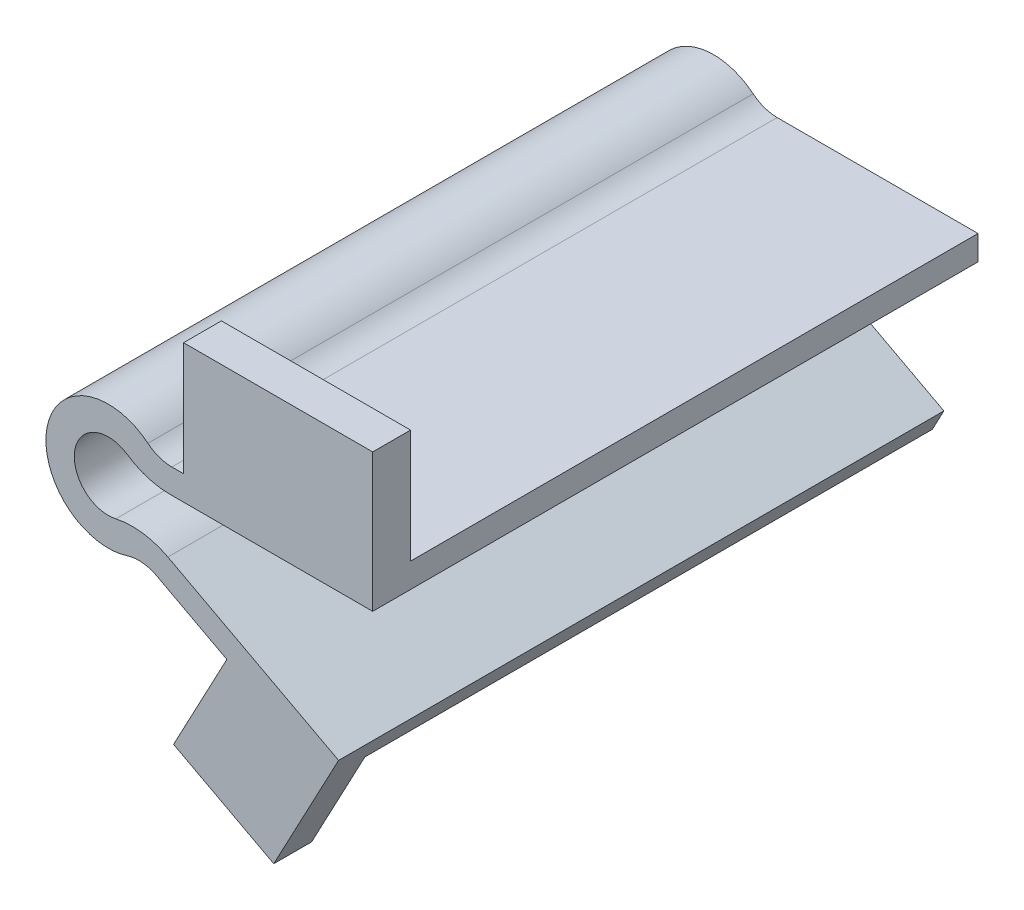
ISO-10303-21;
HEADER;
FILE_DESCRIPTION(('STEP AP214'),'2;1');
FILE_NAME('part.step','',(''),(''),'','','');
FILE_SCHEMA(('AUTOMOTIVE_DESIGN { 1 0 10303 214 1 1 1 1 }'));
ENDSEC;
DATA;
#1=APPLICATION_CONTEXT('core data for automotive mechanical design processes');
#2=APPLICATION_PROTOCOL_DEFINITION('international standard','automotive_design',2000,#1);
#3=PRODUCT_CONTEXT('',#1,'mechanical');
#4=PRODUCT('Part','Part','',(#3));
#5=PRODUCT_RELATED_PRODUCT_CATEGORY('part','',(#4));
#6=PRODUCT_DEFINITION_FORMATION('','',#4);
#7=PRODUCT_DEFINITION_CONTEXT('part definition',#1,'design');
#8=PRODUCT_DEFINITION('design','',#6,#7);
#9=PRODUCT_DEFINITION_SHAPE('','',#8);
#10=(LENGTH_UNIT() NAMED_UNIT(*) SI_UNIT(.MILLI.,.METRE.));
#11=(NAMED_UNIT(*) PLANE_ANGLE_UNIT() SI_UNIT($,.RADIAN.));
#12=(NAMED_UNIT(*) SI_UNIT($,.STERADIAN.) SOLID_ANGLE_UNIT());
#13=UNCERTAINTY_MEASURE_WITH_UNIT(LENGTH_MEASURE(1.E-05),#10,'distance_accuracy_value','');
#14=(GEOMETRIC_REPRESENTATION_CONTEXT(3) GLOBAL_UNCERTAINTY_ASSIGNED_CONTEXT((#13)) GLOBAL_UNIT_ASSIGNED_CONTEXT((#10,
#11,#12)) REPRESENTATION_CONTEXT('',''));
#15=CARTESIAN_POINT('',(0.,0.,0.));
#16=DIRECTION('',(0.,0.,1.));
#17=DIRECTION('',(1.,0.,0.));
#18=AXIS2_PLACEMENT_3D('',#15,#16,#17);
#19=CARTESIAN_POINT('',(0.,0.,16.));
#20=DIRECTION('',(0.,0.,-1.));
#21=DIRECTION('',(-1.,0.,0.));
#22=AXIS2_PLACEMENT_3D('',#19,#20,#21);
#23=CYLINDRICAL_SURFACE('',#22,0.9);
#24=CARTESIAN_POINT('',(0.,0.,0.));
#25=DIRECTION('',(0.,0.,1.));
#26=DIRECTION('',(1.,0.,0.));
#27=AXIS2_PLACEMENT_3D('',#24,#25,#26);
#28=CIRCLE('',#27,0.9);
#29=CARTESIAN_POINT('',(0.505204777120336,0.744827586206896,0.));
#30=VERTEX_POINT('',#29);
#31=CARTESIAN_POINT('',(0.197206421530003,-0.878128479954574,0.));
#32=VERTEX_POINT('',#31);
#33=EDGE_CURVE('E212',#30,#32,#28,.T.);
#34=ORIENTED_EDGE('',*,*,#33,.F.);
#35=DIRECTION('',(0.,0.,-1.));
#36=VECTOR('',#35,1.);
#37=CARTESIAN_POINT('',(0.505204777120336,0.744827586206896,16.));
#38=LINE('',#37,#36);
#39=CARTESIAN_POINT('',(0.505204777120336,0.744827586206896,16.));
#40=VERTEX_POINT('',#39);
#41=EDGE_CURVE('E294',#30,#40,#38,.F.);
#42=ORIENTED_EDGE('',*,*,#41,.T.);
#43=CARTESIAN_POINT('',(0.,0.,16.));
#44=DIRECTION('',(0.,0.,1.));
#45=DIRECTION('',(1.,0.,0.));
#46=AXIS2_PLACEMENT_3D('',#43,#44,#45);
#47=CIRCLE('',#46,0.9);
#48=CARTESIAN_POINT('',(0.197206421530003,-0.878128479954574,16.));
#49=VERTEX_POINT('',#48);
#50=EDGE_CURVE('E217',#40,#49,#47,.T.);
#51=ORIENTED_EDGE('',*,*,#50,.T.);
#52=DIRECTION('',(0.,0.,-1.));
#53=VECTOR('',#52,1.);
#54=CARTESIAN_POINT('',(0.197206421530003,-0.878128479954574,16.));
#55=LINE('',#54,#53);
#56=EDGE_CURVE('E291',#49,#32,#55,.T.);
#57=ORIENTED_EDGE('',*,*,#56,.T.);
#58=EDGE_LOOP('',(#34,#42,#51,#57));
#59=FACE_BOUND('',#58,.T.);
#60=ADVANCED_FACE('F34',(#59),#23,.F.);
#61=CARTESIAN_POINT('',(0.,0.399999999999999,16.));
#62=DIRECTION('',(0.,-1.,0.));
#63=DIRECTION('',(1.,0.,0.));
#64=AXIS2_PLACEMENT_3D('',#61,#62,#63);
#65=PLANE('',#64);
#66=DIRECTION('',(-1.,0.,0.));
#67=VECTOR('',#66,1.);
#68=CARTESIAN_POINT('',(0.,0.399999999999999,16.));
#69=LINE('',#68,#67);
#70=CARTESIAN_POINT('',(6.98856208386246,0.4,16.));
#71=VERTEX_POINT('',#70);
#72=CARTESIAN_POINT('',(1.62788205960997,0.399999999999999,16.));
#73=VERTEX_POINT('',#72);
#74=EDGE_CURVE('E220',#71,#73,#69,.T.);
#75=ORIENTED_EDGE('',*,*,#74,.T.);
#76=DIRECTION('',(0.,0.,-1.));
#77=VECTOR('',#76,1.);
#78=CARTESIAN_POINT('',(1.62788205960997,0.399999999999999,16.));
#79=LINE('',#78,#77);
#80=CARTESIAN_POINT('',(1.62788205960997,0.399999999999999,0.));
#81=VERTEX_POINT('',#80);
#82=EDGE_CURVE('E284',#73,#81,#79,.T.);
#83=ORIENTED_EDGE('',*,*,#82,.T.);
#84=DIRECTION('',(-1.,0.,0.));
#85=VECTOR('',#84,1.);
#86=CARTESIAN_POINT('',(0.,0.399999999999999,0.));
#87=LINE('',#86,#85);
#88=CARTESIAN_POINT('',(6.98856208386246,0.4,0.));
#89=VERTEX_POINT('',#88);
#90=EDGE_CURVE('E241',#89,#81,#87,.T.);
#91=ORIENTED_EDGE('',*,*,#90,.F.);
#92=DIRECTION('',(0.,0.,-1.));
#93=VECTOR('',#92,1.);
#94=CARTESIAN_POINT('',(6.98856208386246,0.4,16.));
#95=LINE('',#94,#93);
#96=EDGE_CURVE('E264',#71,#89,#95,.T.);
#97=ORIENTED_EDGE('',*,*,#96,.F.);
#98=EDGE_LOOP('',(#75,#83,#91,#97));
#99=FACE_BOUND('',#98,.T.);
#100=ADVANCED_FACE('F306',(#99),#65,.T.);
#101=CARTESIAN_POINT('',(6.98856208386246,0.,16.));
#102=DIRECTION('',(-1.,0.,0.));
#103=DIRECTION('',(0.,0.,1.));
#104=AXIS2_PLACEMENT_3D('',#101,#102,#103);
#105=PLANE('',#104);
#106=DIRECTION('',(0.,1.,0.));
#107=VECTOR('',#106,1.);
#108=CARTESIAN_POINT('',(6.98856208386246,0.,0.));
#109=LINE('',#108,#107);
#110=CARTESIAN_POINT('',(6.98856208386246,1.05,0.));
#111=VERTEX_POINT('',#110);
#112=EDGE_CURVE('E244',#89,#111,#109,.T.);
#113=ORIENTED_EDGE('',*,*,#112,.T.);
#114=DIRECTION('',(0.,0.,-1.));
#115=VECTOR('',#114,1.);
#116=CARTESIAN_POINT('',(6.98856208386246,1.05,16.));
#117=LINE('',#116,#115);
#118=CARTESIAN_POINT('',(6.98856208386246,1.05,15.));
#119=VERTEX_POINT('',#118);
#120=EDGE_CURVE('E262',#119,#111,#117,.T.);
#121=ORIENTED_EDGE('',*,*,#120,.F.);
#122=DIRECTION('',(0.,1.,0.));
#123=VECTOR('',#122,1.);
#124=CARTESIAN_POINT('',(6.98856208386246,1.05,15.));
#125=LINE('',#124,#123);
#126=CARTESIAN_POINT('',(6.98856208386246,4.05,15.));
#127=VERTEX_POINT('',#126);
#128=EDGE_CURVE('E196',#119,#127,#125,.T.);
#129=ORIENTED_EDGE('',*,*,#128,.T.);
#130=DIRECTION('',(0.,0.,1.));
#131=VECTOR('',#130,1.);
#132=CARTESIAN_POINT('',(6.98856208386246,4.05,15.));
#133=LINE('',#132,#131);
#134=CARTESIAN_POINT('',(6.98856208386246,4.05,16.));
#135=VERTEX_POINT('',#134);
#136=EDGE_CURVE('E206',#127,#135,#133,.T.);
#137=ORIENTED_EDGE('',*,*,#136,.T.);
#138=DIRECTION('',(0.,1.,0.));
#139=VECTOR('',#138,1.);
#140=CARTESIAN_POINT('',(6.98856208386246,0.,16.));
#141=LINE('',#140,#139);
#142=EDGE_CURVE('E224',#71,#135,#141,.T.);
#143=ORIENTED_EDGE('',*,*,#142,.F.);
#144=ORIENTED_EDGE('',*,*,#96,.T.);
#145=EDGE_LOOP('',(#113,#121,#129,#137,#143,#144));
#146=FACE_BOUND('',#145,.T.);
#147=ADVANCED_FACE('F347',(#146),#105,.F.);
#148=CARTESIAN_POINT('',(0.,1.05,16.));
#149=DIRECTION('',(0.,1.,0.));
#150=DIRECTION('',(-1.,0.,0.));
#151=AXIS2_PLACEMENT_3D('',#148,#149,#150);
#152=PLANE('',#151);
#153=DIRECTION('',(0.,0.,1.));
#154=VECTOR('',#153,1.);
#155=CARTESIAN_POINT('',(1.98856208386246,1.05,15.));
#156=LINE('',#155,#154);
#157=CARTESIAN_POINT('',(1.98856208386246,1.05,15.));
#158=VERTEX_POINT('',#157);
#159=CARTESIAN_POINT('',(1.98856208386246,1.05,16.));
#160=VERTEX_POINT('',#159);
#161=EDGE_CURVE('E49',#158,#160,#156,.T.);
#162=ORIENTED_EDGE('',*,*,#161,.F.);
#163=DIRECTION('',(1.,0.,0.));
#164=VECTOR('',#163,1.);
#165=CARTESIAN_POINT('',(6.98856208386246,1.05,15.));
#166=LINE('',#165,#164);
#167=EDGE_CURVE('E54',#158,#119,#166,.T.);
#168=ORIENTED_EDGE('',*,*,#167,.T.);
#169=ORIENTED_EDGE('',*,*,#120,.T.);
#170=DIRECTION('',(1.,0.,0.));
#171=VECTOR('',#170,1.);
#172=CARTESIAN_POINT('',(0.,1.05,0.));
#173=LINE('',#172,#171);
#174=CARTESIAN_POINT('',(1.67928556237467,1.05,0.));
#175=VERTEX_POINT('',#174);
#176=EDGE_CURVE('E247',#175,#111,#173,.T.);
#177=ORIENTED_EDGE('',*,*,#176,.F.);
#178=DIRECTION('',(0.,0.,-1.));
#179=VECTOR('',#178,1.);
#180=CARTESIAN_POINT('',(1.67928556237467,1.05,16.));
#181=LINE('',#180,#179);
#182=CARTESIAN_POINT('',(1.67928556237467,1.05,16.));
#183=VERTEX_POINT('',#182);
#184=EDGE_CURVE('E271',#175,#183,#181,.F.);
#185=ORIENTED_EDGE('',*,*,#184,.T.);
#186=DIRECTION('',(1.,0.,0.));
#187=VECTOR('',#186,1.);
#188=CARTESIAN_POINT('',(0.,1.05,16.));
#189=LINE('',#188,#187);
#190=EDGE_CURVE('E226',#183,#160,#189,.T.);
#191=ORIENTED_EDGE('',*,*,#190,.T.);
#192=EDGE_LOOP('',(#162,#168,#169,#177,#185,#191));
#193=FACE_BOUND('',#192,.T.);
#194=ADVANCED_FACE('F344',(#193),#152,.T.);
#195=CARTESIAN_POINT('',(0.,0.,16.));
#196=DIRECTION('',(0.,0.,-1.));
#197=DIRECTION('',(-1.,0.,0.));
#198=AXIS2_PLACEMENT_3D('',#195,#196,#197);
#199=CYLINDRICAL_SURFACE('',#198,1.65);
#200=CARTESIAN_POINT('',(0.,0.,16.));
#201=DIRECTION('',(0.,0.,1.));
#202=DIRECTION('',(1.,0.,0.));
#203=AXIS2_PLACEMENT_3D('',#200,#201,#202);
#204=CIRCLE('',#203,1.65);
#205=CARTESIAN_POINT('',(1.04559289732762,1.27641509433962,16.));
#206=VERTEX_POINT('',#205);
#207=CARTESIAN_POINT('',(0.502317829476726,-1.57167961054084,16.));
#208=VERTEX_POINT('',#207);
#209=EDGE_CURVE('E228',#206,#208,#204,.T.);
#210=ORIENTED_EDGE('',*,*,#209,.F.);
#211=DIRECTION('',(0.,0.,-1.));
#212=VECTOR('',#211,1.);
#213=CARTESIAN_POINT('',(1.04559289732762,1.27641509433962,16.));
#214=LINE('',#213,#212);
#215=CARTESIAN_POINT('',(1.04559289732762,1.27641509433962,0.));
#216=VERTEX_POINT('',#215);
#217=EDGE_CURVE('E268',#206,#216,#214,.T.);
#218=ORIENTED_EDGE('',*,*,#217,.T.);
#219=CARTESIAN_POINT('',(0.,0.,0.));
#220=DIRECTION('',(0.,0.,1.));
#221=DIRECTION('',(1.,0.,0.));
#222=AXIS2_PLACEMENT_3D('',#219,#220,#221);
#223=CIRCLE('',#222,1.65);
#224=CARTESIAN_POINT('',(0.502317829476726,-1.57167961054084,0.));
#225=VERTEX_POINT('',#224);
#226=EDGE_CURVE('E250',#216,#225,#223,.T.);
#227=ORIENTED_EDGE('',*,*,#226,.T.);
#228=DIRECTION('',(0.,0.,-1.));
#229=VECTOR('',#228,1.);
#230=CARTESIAN_POINT('',(0.502317829476726,-1.57167961054084,16.));
#231=LINE('',#230,#229);
#232=EDGE_CURVE('E266',#225,#208,#231,.F.);
#233=ORIENTED_EDGE('',*,*,#232,.T.);
#234=EDGE_LOOP('',(#210,#218,#227,#233));
#235=FACE_BOUND('',#234,.T.);
#236=ADVANCED_FACE('F336',(#235),#199,.T.);
#237=CARTESIAN_POINT('',(-0.399050828368008,-0.750505453930088,16.));
#238=DIRECTION('',(0.469471562785892,0.882947592858926,0.));
#239=DIRECTION('',(-0.882947592858926,0.469471562785892,0.));
#240=AXIS2_PLACEMENT_3D('',#237,#238,#239);
#241=PLANE('',#240);
#242=DIRECTION('',(-0.882947592858927,0.469471562785892,0.));
#243=VECTOR('',#242,1.);
#244=CARTESIAN_POINT('',(3.1327395430677,-2.62839170507366,15.));
#245=LINE('',#244,#243);
#246=CARTESIAN_POINT('',(5.78158232164448,-4.03680639343133,15.));
#247=VERTEX_POINT('',#246);
#248=CARTESIAN_POINT('',(3.1327395430677,-2.62839170507366,15.));
#249=VERTEX_POINT('',#248);
#250=EDGE_CURVE('E174',#247,#249,#245,.T.);
#251=ORIENTED_EDGE('',*,*,#250,.T.);
#252=DIRECTION('',(0.,0.,1.));
#253=VECTOR('',#252,1.);
#254=CARTESIAN_POINT('',(3.1327395430677,-2.62839170507366,15.));
#255=LINE('',#254,#253);
#256=CARTESIAN_POINT('',(3.1327395430677,-2.62839170507366,16.));
#257=VERTEX_POINT('',#256);
#258=EDGE_CURVE('E157',#249,#257,#255,.T.);
#259=ORIENTED_EDGE('',*,*,#258,.T.);
#260=DIRECTION('',(0.882947592858926,-0.469471562785892,0.));
#261=VECTOR('',#260,1.);
#262=CARTESIAN_POINT('',(-0.399050828368008,-0.750505453930088,16.));
#263=LINE('',#262,#261);
#264=CARTESIAN_POINT('',(1.27622444043033,-1.64126511497939,16.));
#265=VERTEX_POINT('',#264);
#266=EDGE_CURVE('E231',#265,#257,#263,.T.);
#267=ORIENTED_EDGE('',*,*,#266,.F.);
#268=DIRECTION('',(0.,0.,1.));
#269=VECTOR('',#268,1.);
#270=CARTESIAN_POINT('',(1.27622444043033,-1.64126511497939,0.));
#271=LINE('',#270,#269);
#272=CARTESIAN_POINT('',(1.27622444043033,-1.64126511497939,0.));
#273=VERTEX_POINT('',#272);
#274=EDGE_CURVE('E273',#265,#273,#271,.F.);
#275=ORIENTED_EDGE('',*,*,#274,.T.);
#276=DIRECTION('',(0.882947592858926,-0.469471562785892,0.));
#277=VECTOR('',#276,1.);
#278=CARTESIAN_POINT('',(-0.399050828368008,-0.750505453930088,0.));
#279=LINE('',#278,#277);
#280=CARTESIAN_POINT('',(5.78158232164448,-4.03680639343133,0.));
#281=VERTEX_POINT('',#280);
#282=EDGE_CURVE('E253',#273,#281,#279,.T.);
#283=ORIENTED_EDGE('',*,*,#282,.T.);
#284=DIRECTION('',(0.,0.,-1.));
#285=VECTOR('',#284,1.);
#286=CARTESIAN_POINT('',(5.78158232164448,-4.03680639343133,16.));
#287=LINE('',#286,#285);
#288=EDGE_CURVE('E182',#247,#281,#287,.T.);
#289=ORIENTED_EDGE('',*,*,#288,.F.);
#290=EDGE_LOOP('',(#251,#259,#267,#275,#283,#289));
#291=FACE_BOUND('',#290,.T.);
#292=ADVANCED_FACE('F180',(#291),#241,.F.);
#293=CARTESIAN_POINT('',(6.18063315001249,-3.28630093950124,16.));
#294=DIRECTION('',(0.882947592858927,-0.469471562785891,0.));
#295=DIRECTION('',(0.469471562785891,0.882947592858927,0.));
#296=AXIS2_PLACEMENT_3D('',#293,#294,#295);
#297=PLANE('',#296);
#298=DIRECTION('',(-0.469471562785891,-0.882947592858927,0.));
#299=VECTOR('',#298,1.);
#300=CARTESIAN_POINT('',(6.18063315001249,-3.28630093950124,0.));
#301=LINE('',#300,#299);
#302=CARTESIAN_POINT('',(6.08673883745531,-3.46289045807303,0.));
#303=VERTEX_POINT('',#302);
#304=EDGE_CURVE('E255',#303,#281,#301,.T.);
#305=ORIENTED_EDGE('',*,*,#304,.F.);
#306=DIRECTION('',(0.,0.,-1.));
#307=VECTOR('',#306,1.);
#308=CARTESIAN_POINT('',(6.08673883745531,-3.46289045807303,16.));
#309=LINE('',#308,#307);
#310=CARTESIAN_POINT('',(6.08673883745531,-3.46289045807303,16.));
#311=VERTEX_POINT('',#310);
#312=EDGE_CURVE('E238',#311,#303,#309,.T.);
#313=ORIENTED_EDGE('',*,*,#312,.F.);
#314=DIRECTION('',(-0.469471562785891,-0.882947592858927,0.));
#315=VECTOR('',#314,1.);
#316=CARTESIAN_POINT('',(6.18063315001249,-3.28630093950124,16.));
#317=LINE('',#316,#315);
#318=CARTESIAN_POINT('',(4.37316763328681,-6.68564917200811,16.));
#319=VERTEX_POINT('',#318);
#320=EDGE_CURVE('E233',#311,#319,#317,.T.);
#321=ORIENTED_EDGE('',*,*,#320,.T.);
#322=DIRECTION('',(0.,0.,1.));
#323=VECTOR('',#322,1.);
#324=CARTESIAN_POINT('',(4.37316763328681,-6.68564917200811,15.));
#325=LINE('',#324,#323);
#326=CARTESIAN_POINT('',(4.37316763328681,-6.68564917200811,15.));
#327=VERTEX_POINT('',#326);
#328=EDGE_CURVE('E191',#327,#319,#325,.T.);
#329=ORIENTED_EDGE('',*,*,#328,.F.);
#330=DIRECTION('',(0.469471562785889,0.882947592858928,0.));
#331=VECTOR('',#330,1.);
#332=CARTESIAN_POINT('',(5.78158232164448,-4.03680639343133,15.));
#333=LINE('',#332,#331);
#334=EDGE_CURVE('E168',#327,#247,#333,.T.);
#335=ORIENTED_EDGE('',*,*,#334,.T.);
#336=ORIENTED_EDGE('',*,*,#288,.T.);
#337=EDGE_LOOP('',(#305,#313,#321,#329,#335,#336));
#338=FACE_BOUND('',#337,.T.);
#339=ADVANCED_FACE('F326',(#338),#297,.T.);
#340=CARTESIAN_POINT('',(-0.0938943125571788,-0.176589518571786,16.));
#341=DIRECTION('',(-0.469471562785892,-0.882947592858927,0.));
#342=DIRECTION('',(0.882947592858927,-0.469471562785892,0.));
#343=AXIS2_PLACEMENT_3D('',#340,#341,#342);
#344=PLANE('',#343);
#345=DIRECTION('',(-0.882947592858927,0.469471562785892,0.));
#346=VECTOR('',#345,1.);
#347=CARTESIAN_POINT('',(-0.0938943125571788,-0.176589518571786,0.));
#348=LINE('',#347,#346);
#349=CARTESIAN_POINT('',(1.57438603939068,-1.063629916358,0.));
#350=VERTEX_POINT('',#349);
#351=EDGE_CURVE('E221',#303,#350,#348,.T.);
#352=ORIENTED_EDGE('',*,*,#351,.T.);
#353=DIRECTION('',(0.,0.,1.));
#354=VECTOR('',#353,1.);
#355=CARTESIAN_POINT('',(1.57438603939068,-1.063629916358,16.));
#356=LINE('',#355,#354);
#357=CARTESIAN_POINT('',(1.57438603939068,-1.063629916358,16.));
#358=VERTEX_POINT('',#357);
#359=EDGE_CURVE('E11',#350,#358,#356,.T.);
#360=ORIENTED_EDGE('',*,*,#359,.T.);
#361=DIRECTION('',(-0.882947592858927,0.469471562785892,0.));
#362=VECTOR('',#361,1.);
#363=CARTESIAN_POINT('',(-0.0938943125571788,-0.176589518571786,16.));
#364=LINE('',#363,#362);
#365=EDGE_CURVE('E235',#311,#358,#364,.T.);
#366=ORIENTED_EDGE('',*,*,#365,.F.);
#367=ORIENTED_EDGE('',*,*,#312,.T.);
#368=EDGE_LOOP('',(#352,#360,#366,#367));
#369=FACE_BOUND('',#368,.T.);
#370=ADVANCED_FACE('F322',(#369),#344,.F.);
#371=CARTESIAN_POINT('',(0.,0.,16.));
#372=DIRECTION('',(0.,0.,1.));
#373=DIRECTION('',(1.,0.,0.));
#374=AXIS2_PLACEMENT_3D('',#371,#372,#373);
#375=PLANE('',#374);
#376=ORIENTED_EDGE('',*,*,#50,.F.);
#377=CARTESIAN_POINT('',(1.62788205960997,2.4,16.));
#378=DIRECTION('',(0.,0.,1.));
#379=DIRECTION('',(1.,0.,0.));
#380=AXIS2_PLACEMENT_3D('',#377,#378,#379);
#381=CIRCLE('',#380,2.);
#382=EDGE_CURVE('E42',#40,#73,#381,.T.);
#383=ORIENTED_EDGE('',*,*,#382,.T.);
#384=ORIENTED_EDGE('',*,*,#74,.F.);
#385=ORIENTED_EDGE('',*,*,#142,.T.);
#386=DIRECTION('',(-1.,0.,0.));
#387=VECTOR('',#386,1.);
#388=CARTESIAN_POINT('',(6.98856208386246,4.05,16.));
#389=LINE('',#388,#387);
#390=CARTESIAN_POINT('',(1.98856208386246,4.05,16.));
#391=VERTEX_POINT('',#390);
#392=EDGE_CURVE('E194',#135,#391,#389,.T.);
#393=ORIENTED_EDGE('',*,*,#392,.T.);
#394=DIRECTION('',(0.,-1.,0.));
#395=VECTOR('',#394,1.);
#396=CARTESIAN_POINT('',(1.98856208386246,4.05,16.));
#397=LINE('',#396,#395);
#398=EDGE_CURVE('E200',#391,#160,#397,.T.);
#399=ORIENTED_EDGE('',*,*,#398,.T.);
#400=ORIENTED_EDGE('',*,*,#190,.F.);
#401=CARTESIAN_POINT('',(1.67928556237467,2.05,16.));
#402=DIRECTION('',(0.,0.,1.));
#403=DIRECTION('',(1.,0.,0.));
#404=AXIS2_PLACEMENT_3D('',#401,#402,#403);
#405=CIRCLE('',#404,1.);
#406=EDGE_CURVE('E278',#183,#206,#405,.F.);
#407=ORIENTED_EDGE('',*,*,#406,.T.);
#408=ORIENTED_EDGE('',*,*,#209,.T.);
#409=CARTESIAN_POINT('',(0.806752877644438,-2.52421270783831,16.));
#410=DIRECTION('',(0.,0.,1.));
#411=DIRECTION('',(1.,0.,0.));
#412=AXIS2_PLACEMENT_3D('',#409,#410,#411);
#413=CIRCLE('',#412,1.);
#414=EDGE_CURVE('E282',#208,#265,#413,.F.);
#415=ORIENTED_EDGE('',*,*,#414,.T.);
#416=ORIENTED_EDGE('',*,*,#266,.T.);
#417=DIRECTION('',(-0.469471562785889,-0.882947592858928,0.));
#418=VECTOR('',#417,1.);
#419=CARTESIAN_POINT('',(1.72432485471003,-5.27723448365045,16.));
#420=LINE('',#419,#418);
#421=CARTESIAN_POINT('',(1.72432485471003,-5.27723448365045,16.));
#422=VERTEX_POINT('',#421);
#423=EDGE_CURVE('E162',#257,#422,#420,.T.);
#424=ORIENTED_EDGE('',*,*,#423,.T.);
#425=DIRECTION('',(0.882947592858928,-0.469471562785888,0.));
#426=VECTOR('',#425,1.);
#427=CARTESIAN_POINT('',(4.37316763328681,-6.68564917200811,16.));
#428=LINE('',#427,#426);
#429=EDGE_CURVE('E183',#422,#319,#428,.T.);
#430=ORIENTED_EDGE('',*,*,#429,.T.);
#431=ORIENTED_EDGE('',*,*,#320,.F.);
#432=ORIENTED_EDGE('',*,*,#365,.T.);
#433=CARTESIAN_POINT('',(0.635442913818898,-2.82952510207585,16.));
#434=DIRECTION('',(0.,0.,1.));
#435=DIRECTION('',(1.,0.,0.));
#436=AXIS2_PLACEMENT_3D('',#433,#434,#435);
#437=CIRCLE('',#436,2.);
#438=EDGE_CURVE('E296',#358,#49,#437,.T.);
#439=ORIENTED_EDGE('',*,*,#438,.T.);
#440=EDGE_LOOP('',(#376,#383,#384,#385,#393,#399,#400,#407,#408,#415,#416,#424,#430,#431,#432,#439));
#441=FACE_BOUND('',#440,.T.);
#442=ADVANCED_FACE('F301',(#441),#375,.T.);
#443=CARTESIAN_POINT('',(0.,0.,0.));
#444=DIRECTION('',(0.,0.,1.));
#445=DIRECTION('',(1.,0.,0.));
#446=AXIS2_PLACEMENT_3D('',#443,#444,#445);
#447=PLANE('',#446);
#448=ORIENTED_EDGE('',*,*,#90,.T.);
#449=CARTESIAN_POINT('',(1.62788205960997,2.4,0.));
#450=DIRECTION('',(0.,0.,1.));
#451=DIRECTION('',(1.,0.,0.));
#452=AXIS2_PLACEMENT_3D('',#449,#450,#451);
#453=CIRCLE('',#452,2.);
#454=EDGE_CURVE('E289',#81,#30,#453,.F.);
#455=ORIENTED_EDGE('',*,*,#454,.T.);
#456=ORIENTED_EDGE('',*,*,#33,.T.);
#457=CARTESIAN_POINT('',(0.635442913818898,-2.82952510207585,0.));
#458=DIRECTION('',(0.,0.,1.));
#459=DIRECTION('',(1.,0.,0.));
#460=AXIS2_PLACEMENT_3D('',#457,#458,#459);
#461=CIRCLE('',#460,2.);
#462=EDGE_CURVE('E287',#32,#350,#461,.F.);
#463=ORIENTED_EDGE('',*,*,#462,.T.);
#464=ORIENTED_EDGE('',*,*,#351,.F.);
#465=ORIENTED_EDGE('',*,*,#304,.T.);
#466=ORIENTED_EDGE('',*,*,#282,.F.);
#467=CARTESIAN_POINT('',(0.806752877644438,-2.52421270783831,0.));
#468=DIRECTION('',(0.,0.,1.));
#469=DIRECTION('',(1.,0.,0.));
#470=AXIS2_PLACEMENT_3D('',#467,#468,#469);
#471=CIRCLE('',#470,1.);
#472=EDGE_CURVE('E280',#273,#225,#471,.T.);
#473=ORIENTED_EDGE('',*,*,#472,.T.);
#474=ORIENTED_EDGE('',*,*,#226,.F.);
#475=CARTESIAN_POINT('',(1.67928556237467,2.05,0.));
#476=DIRECTION('',(0.,0.,1.));
#477=DIRECTION('',(1.,0.,0.));
#478=AXIS2_PLACEMENT_3D('',#475,#476,#477);
#479=CIRCLE('',#478,1.);
#480=EDGE_CURVE('E276',#216,#175,#479,.T.);
#481=ORIENTED_EDGE('',*,*,#480,.T.);
#482=ORIENTED_EDGE('',*,*,#176,.T.);
#483=ORIENTED_EDGE('',*,*,#112,.F.);
#484=EDGE_LOOP('',(#448,#455,#456,#463,#464,#465,#466,#473,#474,#481,#482,#483));
#485=FACE_BOUND('',#484,.T.);
#486=ADVANCED_FACE('F312',(#485),#447,.F.);
#487=CARTESIAN_POINT('',(1.67928556237467,2.05,16.));
#488=DIRECTION('',(0.,0.,-1.));
#489=DIRECTION('',(-1.,0.,0.));
#490=AXIS2_PLACEMENT_3D('',#487,#488,#489);
#491=CYLINDRICAL_SURFACE('',#490,1.);
#492=ORIENTED_EDGE('',*,*,#406,.F.);
#493=ORIENTED_EDGE('',*,*,#184,.F.);
#494=ORIENTED_EDGE('',*,*,#480,.F.);
#495=ORIENTED_EDGE('',*,*,#217,.F.);
#496=EDGE_LOOP('',(#492,#493,#494,#495));
#497=FACE_BOUND('',#496,.T.);
#498=ADVANCED_FACE('F342',(#497),#491,.F.);
#499=CARTESIAN_POINT('',(0.806752877644438,-2.52421270783831,16.));
#500=DIRECTION('',(0.,0.,-1.));
#501=DIRECTION('',(-1.,0.,0.));
#502=AXIS2_PLACEMENT_3D('',#499,#500,#501);
#503=CYLINDRICAL_SURFACE('',#502,1.);
#504=ORIENTED_EDGE('',*,*,#414,.F.);
#505=ORIENTED_EDGE('',*,*,#232,.F.);
#506=ORIENTED_EDGE('',*,*,#472,.F.);
#507=ORIENTED_EDGE('',*,*,#274,.F.);
#508=EDGE_LOOP('',(#504,#505,#506,#507));
#509=FACE_BOUND('',#508,.T.);
#510=ADVANCED_FACE('F332',(#509),#503,.F.);
#511=CARTESIAN_POINT('',(1.62788205960997,2.4,16.));
#512=DIRECTION('',(0.,0.,-1.));
#513=DIRECTION('',(-1.,0.,0.));
#514=AXIS2_PLACEMENT_3D('',#511,#512,#513);
#515=CYLINDRICAL_SURFACE('',#514,2.);
#516=ORIENTED_EDGE('',*,*,#382,.F.);
#517=ORIENTED_EDGE('',*,*,#41,.F.);
#518=ORIENTED_EDGE('',*,*,#454,.F.);
#519=ORIENTED_EDGE('',*,*,#82,.F.);
#520=EDGE_LOOP('',(#516,#517,#518,#519));
#521=FACE_BOUND('',#520,.T.);
#522=ADVANCED_FACE('F309',(#521),#515,.T.);
#523=CARTESIAN_POINT('',(0.635442913818898,-2.82952510207585,16.));
#524=DIRECTION('',(0.,0.,-1.));
#525=DIRECTION('',(-1.,0.,0.));
#526=AXIS2_PLACEMENT_3D('',#523,#524,#525);
#527=CYLINDRICAL_SURFACE('',#526,2.);
#528=ORIENTED_EDGE('',*,*,#438,.F.);
#529=ORIENTED_EDGE('',*,*,#359,.F.);
#530=ORIENTED_EDGE('',*,*,#462,.F.);
#531=ORIENTED_EDGE('',*,*,#56,.F.);
#532=EDGE_LOOP('',(#528,#529,#530,#531));
#533=FACE_BOUND('',#532,.T.);
#534=ADVANCED_FACE('F36',(#533),#527,.T.);
#535=CARTESIAN_POINT('',(1.98856208386246,4.05,15.));
#536=DIRECTION('',(-1.,0.,0.));
#537=DIRECTION('',(0.,-1.,0.));
#538=AXIS2_PLACEMENT_3D('',#535,#536,#537);
#539=PLANE('',#538);
#540=ORIENTED_EDGE('',*,*,#398,.F.);
#541=DIRECTION('',(0.,0.,1.));
#542=VECTOR('',#541,1.);
#543=CARTESIAN_POINT('',(1.98856208386246,4.05,15.));
#544=LINE('',#543,#542);
#545=CARTESIAN_POINT('',(1.98856208386246,4.05,15.));
#546=VERTEX_POINT('',#545);
#547=EDGE_CURVE('E213',#546,#391,#544,.T.);
#548=ORIENTED_EDGE('',*,*,#547,.F.);
#549=DIRECTION('',(0.,-1.,0.));
#550=VECTOR('',#549,1.);
#551=CARTESIAN_POINT('',(1.98856208386246,4.05,15.));
#552=LINE('',#551,#550);
#553=EDGE_CURVE('E203',#546,#158,#552,.T.);
#554=ORIENTED_EDGE('',*,*,#553,.T.);
#555=ORIENTED_EDGE('',*,*,#161,.T.);
#556=EDGE_LOOP('',(#540,#548,#554,#555));
#557=FACE_BOUND('',#556,.T.);
#558=ADVANCED_FACE('F357',(#557),#539,.T.);
#559=CARTESIAN_POINT('',(6.98856208386246,4.05,15.));
#560=DIRECTION('',(0.,1.,0.));
#561=DIRECTION('',(-1.,0.,0.));
#562=AXIS2_PLACEMENT_3D('',#559,#560,#561);
#563=PLANE('',#562);
#564=ORIENTED_EDGE('',*,*,#392,.F.);
#565=ORIENTED_EDGE('',*,*,#136,.F.);
#566=DIRECTION('',(-1.,0.,0.));
#567=VECTOR('',#566,1.);
#568=CARTESIAN_POINT('',(6.98856208386246,4.05,15.));
#569=LINE('',#568,#567);
#570=EDGE_CURVE('E199',#127,#546,#569,.T.);
#571=ORIENTED_EDGE('',*,*,#570,.T.);
#572=ORIENTED_EDGE('',*,*,#547,.T.);
#573=EDGE_LOOP('',(#564,#565,#571,#572));
#574=FACE_BOUND('',#573,.T.);
#575=ADVANCED_FACE('F354',(#574),#563,.T.);
#576=CARTESIAN_POINT('',(0.,0.,15.));
#577=DIRECTION('',(0.,0.,1.));
#578=DIRECTION('',(1.,0.,0.));
#579=AXIS2_PLACEMENT_3D('',#576,#577,#578);
#580=PLANE('',#579);
#581=ORIENTED_EDGE('',*,*,#128,.F.);
#582=ORIENTED_EDGE('',*,*,#167,.F.);
#583=ORIENTED_EDGE('',*,*,#553,.F.);
#584=ORIENTED_EDGE('',*,*,#570,.F.);
#585=EDGE_LOOP('',(#581,#582,#583,#584));
#586=FACE_BOUND('',#585,.T.);
#587=ADVANCED_FACE('F350',(#586),#580,.F.);
#588=CARTESIAN_POINT('',(4.37316763328681,-6.68564917200811,15.));
#589=DIRECTION('',(-0.469471562785888,-0.882947592858929,0.));
#590=DIRECTION('',(0.882947592858929,-0.469471562785888,0.));
#591=AXIS2_PLACEMENT_3D('',#588,#589,#590);
#592=PLANE('',#591);
#593=ORIENTED_EDGE('',*,*,#429,.F.);
#594=DIRECTION('',(0.,0.,1.));
#595=VECTOR('',#594,1.);
#596=CARTESIAN_POINT('',(1.72432485471003,-5.27723448365045,15.));
#597=LINE('',#596,#595);
#598=CARTESIAN_POINT('',(1.72432485471003,-5.27723448365045,15.));
#599=VERTEX_POINT('',#598);
#600=EDGE_CURVE('E167',#599,#422,#597,.T.);
#601=ORIENTED_EDGE('',*,*,#600,.F.);
#602=DIRECTION('',(0.882947592858928,-0.469471562785888,0.));
#603=VECTOR('',#602,1.);
#604=CARTESIAN_POINT('',(4.37316763328681,-6.68564917200811,15.));
#605=LINE('',#604,#603);
#606=EDGE_CURVE('E177',#599,#327,#605,.T.);
#607=ORIENTED_EDGE('',*,*,#606,.T.);
#608=ORIENTED_EDGE('',*,*,#328,.T.);
#609=EDGE_LOOP('',(#593,#601,#607,#608));
#610=FACE_BOUND('',#609,.T.);
#611=ADVANCED_FACE('F455',(#610),#592,.T.);
#612=CARTESIAN_POINT('',(1.72432485471003,-5.27723448365045,15.));
#613=DIRECTION('',(-0.882947592858928,0.469471562785889,0.));
#614=DIRECTION('',(-0.469471562785889,-0.882947592858928,0.));
#615=AXIS2_PLACEMENT_3D('',#612,#613,#614);
#616=PLANE('',#615);
#617=ORIENTED_EDGE('',*,*,#423,.F.);
#618=ORIENTED_EDGE('',*,*,#258,.F.);
#619=DIRECTION('',(-0.469471562785889,-0.882947592858928,0.));
#620=VECTOR('',#619,1.);
#621=CARTESIAN_POINT('',(1.72432485471003,-5.27723448365045,15.));
#622=LINE('',#621,#620);
#623=EDGE_CURVE('E160',#249,#599,#622,.T.);
#624=ORIENTED_EDGE('',*,*,#623,.T.);
#625=ORIENTED_EDGE('',*,*,#600,.T.);
#626=EDGE_LOOP('',(#617,#618,#624,#625));
#627=FACE_BOUND('',#626,.T.);
#628=ADVANCED_FACE('F159',(#627),#616,.T.);
#629=CARTESIAN_POINT('',(0.,0.,15.));
#630=DIRECTION('',(0.,0.,-1.));
#631=DIRECTION('',(-1.,0.,0.));
#632=AXIS2_PLACEMENT_3D('',#629,#630,#631);
#633=PLANE('',#632);
#634=ORIENTED_EDGE('',*,*,#250,.F.);
#635=ORIENTED_EDGE('',*,*,#334,.F.);
#636=ORIENTED_EDGE('',*,*,#606,.F.);
#637=ORIENTED_EDGE('',*,*,#623,.F.);
#638=EDGE_LOOP('',(#634,#635,#636,#637));
#639=FACE_BOUND('',#638,.T.);
#640=ADVANCED_FACE('F172',(#639),#633,.T.);
#641=CLOSED_SHELL('',(#60,#100,#147,#194,#236,#292,#339,#370,#442,#486,#498,#510,#522,#534,#558,
#575,#587,#611,#628,#640));
#642=MANIFOLD_SOLID_BREP('B2',#641);
#643=ADVANCED_BREP_SHAPE_REPRESENTATION('',(#18,#642),#14);
#644=SHAPE_DEFINITION_REPRESENTATION(#9,#643);
ENDSEC;
END-ISO-10303-21;
